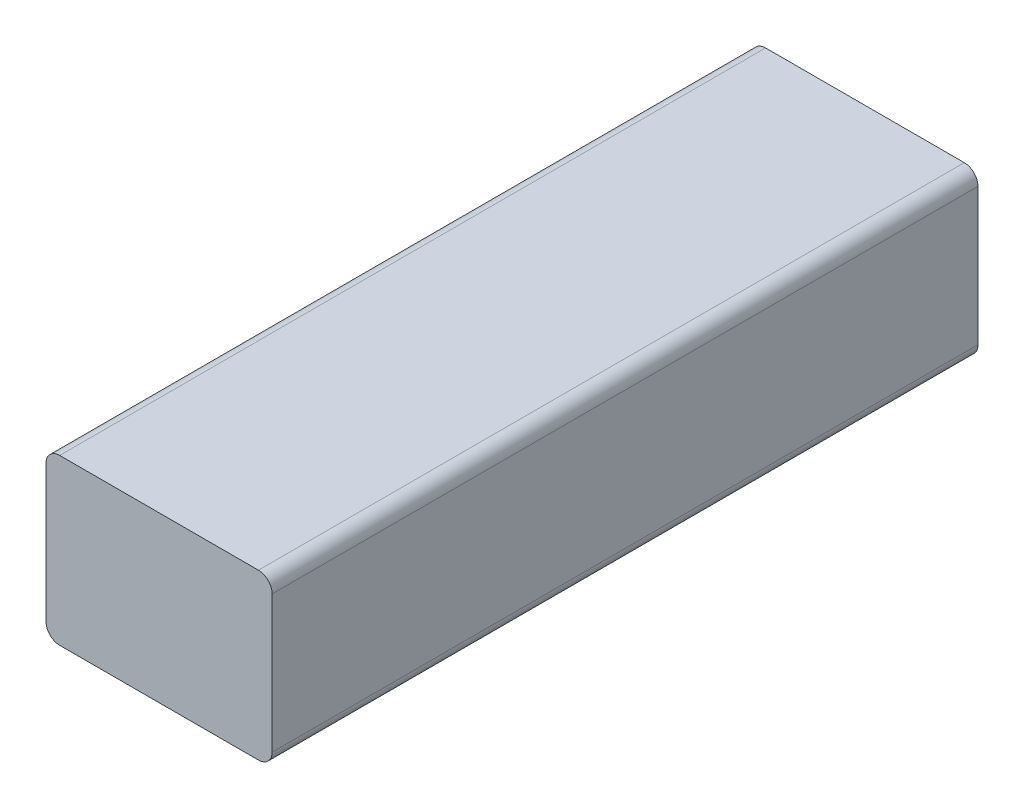
ISO-10303-21;
HEADER;
FILE_DESCRIPTION(('STEP AP214'),'2;1');
FILE_NAME('part.step','',(''),(''),'','','');
FILE_SCHEMA(('AUTOMOTIVE_DESIGN { 1 0 10303 214 1 1 1 1 }'));
ENDSEC;
DATA;
#1=APPLICATION_CONTEXT('core data for automotive mechanical design processes');
#2=APPLICATION_PROTOCOL_DEFINITION('international standard','automotive_design',2000,#1);
#3=PRODUCT_CONTEXT('',#1,'mechanical');
#4=PRODUCT('Part','Part','',(#3));
#5=PRODUCT_RELATED_PRODUCT_CATEGORY('part','',(#4));
#6=PRODUCT_DEFINITION_FORMATION('','',#4);
#7=PRODUCT_DEFINITION_CONTEXT('part definition',#1,'design');
#8=PRODUCT_DEFINITION('design','',#6,#7);
#9=PRODUCT_DEFINITION_SHAPE('','',#8);
#10=(LENGTH_UNIT() NAMED_UNIT(*) SI_UNIT(.MILLI.,.METRE.));
#11=(NAMED_UNIT(*) PLANE_ANGLE_UNIT() SI_UNIT($,.RADIAN.));
#12=(NAMED_UNIT(*) SI_UNIT($,.STERADIAN.) SOLID_ANGLE_UNIT());
#13=UNCERTAINTY_MEASURE_WITH_UNIT(LENGTH_MEASURE(1.E-05),#10,'distance_accuracy_value','');
#14=(GEOMETRIC_REPRESENTATION_CONTEXT(3) GLOBAL_UNCERTAINTY_ASSIGNED_CONTEXT((#13)) GLOBAL_UNIT_ASSIGNED_CONTEXT((#10,
#11,#12)) REPRESENTATION_CONTEXT('',''));
#15=CARTESIAN_POINT('',(0.,0.,0.));
#16=DIRECTION('',(0.,0.,1.));
#17=DIRECTION('',(1.,0.,0.));
#18=AXIS2_PLACEMENT_3D('',#15,#16,#17);
#19=CARTESIAN_POINT('',(16.5,24.,51.5));
#20=DIRECTION('',(-1.,0.,0.));
#21=DIRECTION('',(0.,0.,1.));
#22=AXIS2_PLACEMENT_3D('',#19,#20,#21);
#23=PLANE('',#22);
#24=DIRECTION('',(0.,-1.,0.));
#25=VECTOR('',#24,1.);
#26=CARTESIAN_POINT('',(16.5,24.,51.5));
#27=LINE('',#26,#25);
#28=CARTESIAN_POINT('',(16.5,22.,51.5));
#29=VERTEX_POINT('',#28);
#30=CARTESIAN_POINT('',(16.5,2.,51.5));
#31=VERTEX_POINT('',#30);
#32=EDGE_CURVE('E125',#29,#31,#27,.T.);
#33=ORIENTED_EDGE('',*,*,#32,.T.);
#34=DIRECTION('',(0.,0.,-1.));
#35=VECTOR('',#34,1.);
#36=CARTESIAN_POINT('',(16.5,2.,-51.5));
#37=LINE('',#36,#35);
#38=CARTESIAN_POINT('',(16.5,2.,-51.5));
#39=VERTEX_POINT('',#38);
#40=EDGE_CURVE('E11',#31,#39,#37,.T.);
#41=ORIENTED_EDGE('',*,*,#40,.T.);
#42=DIRECTION('',(0.,-1.,0.));
#43=VECTOR('',#42,1.);
#44=CARTESIAN_POINT('',(16.5,24.,-51.5));
#45=LINE('',#44,#43);
#46=CARTESIAN_POINT('',(16.5,22.,-51.5));
#47=VERTEX_POINT('',#46);
#48=EDGE_CURVE('E130',#47,#39,#45,.T.);
#49=ORIENTED_EDGE('',*,*,#48,.F.);
#50=DIRECTION('',(0.,0.,-1.));
#51=VECTOR('',#50,1.);
#52=CARTESIAN_POINT('',(16.5,22.,51.5));
#53=LINE('',#52,#51);
#54=EDGE_CURVE('E45',#47,#29,#53,.F.);
#55=ORIENTED_EDGE('',*,*,#54,.T.);
#56=EDGE_LOOP('',(#33,#41,#49,#55));
#57=FACE_BOUND('',#56,.T.);
#58=ADVANCED_FACE('F37',(#57),#23,.F.);
#59=CARTESIAN_POINT('',(-16.5,24.,-51.5));
#60=DIRECTION('',(0.,0.,1.));
#61=DIRECTION('',(1.,0.,0.));
#62=AXIS2_PLACEMENT_3D('',#59,#60,#61);
#63=PLANE('',#62);
#64=DIRECTION('',(-1.,0.,0.));
#65=VECTOR('',#64,1.);
#66=CARTESIAN_POINT('',(-16.5,0.,-51.5));
#67=LINE('',#66,#65);
#68=CARTESIAN_POINT('',(14.5,0.,-51.5));
#69=VERTEX_POINT('',#68);
#70=CARTESIAN_POINT('',(-14.5,0.,-51.5));
#71=VERTEX_POINT('',#70);
#72=EDGE_CURVE('E172',#69,#71,#67,.T.);
#73=ORIENTED_EDGE('',*,*,#72,.T.);
#74=CARTESIAN_POINT('',(-14.5,2.,-51.5));
#75=DIRECTION('',(0.,0.,1.));
#76=DIRECTION('',(1.,0.,0.));
#77=AXIS2_PLACEMENT_3D('',#74,#75,#76);
#78=CIRCLE('',#77,2.);
#79=CARTESIAN_POINT('',(-16.5,2.,-51.5));
#80=VERTEX_POINT('',#79);
#81=EDGE_CURVE('E147',#71,#80,#78,.F.);
#82=ORIENTED_EDGE('',*,*,#81,.T.);
#83=DIRECTION('',(0.,-1.,0.));
#84=VECTOR('',#83,1.);
#85=CARTESIAN_POINT('',(-16.5,24.,-51.5));
#86=LINE('',#85,#84);
#87=CARTESIAN_POINT('',(-16.5,22.,-51.5));
#88=VERTEX_POINT('',#87);
#89=EDGE_CURVE('E124',#88,#80,#86,.T.);
#90=ORIENTED_EDGE('',*,*,#89,.F.);
#91=CARTESIAN_POINT('',(-14.5,22.,-51.5));
#92=DIRECTION('',(0.,0.,1.));
#93=DIRECTION('',(1.,0.,0.));
#94=AXIS2_PLACEMENT_3D('',#91,#92,#93);
#95=CIRCLE('',#94,2.);
#96=CARTESIAN_POINT('',(-14.5,24.,-51.5));
#97=VERTEX_POINT('',#96);
#98=EDGE_CURVE('E129',#88,#97,#95,.F.);
#99=ORIENTED_EDGE('',*,*,#98,.T.);
#100=DIRECTION('',(-1.,0.,0.));
#101=VECTOR('',#100,1.);
#102=CARTESIAN_POINT('',(-16.5,24.,-51.5));
#103=LINE('',#102,#101);
#104=CARTESIAN_POINT('',(14.5,24.,-51.5));
#105=VERTEX_POINT('',#104);
#106=EDGE_CURVE('E166',#105,#97,#103,.T.);
#107=ORIENTED_EDGE('',*,*,#106,.F.);
#108=CARTESIAN_POINT('',(14.5,22.,-51.5));
#109=DIRECTION('',(0.,0.,1.));
#110=DIRECTION('',(1.,0.,0.));
#111=AXIS2_PLACEMENT_3D('',#108,#109,#110);
#112=CIRCLE('',#111,2.);
#113=EDGE_CURVE('E59',#105,#47,#112,.F.);
#114=ORIENTED_EDGE('',*,*,#113,.T.);
#115=ORIENTED_EDGE('',*,*,#48,.T.);
#116=CARTESIAN_POINT('',(14.5,2.,-51.5));
#117=DIRECTION('',(0.,0.,1.));
#118=DIRECTION('',(1.,0.,0.));
#119=AXIS2_PLACEMENT_3D('',#116,#117,#118);
#120=CIRCLE('',#119,2.);
#121=EDGE_CURVE('E52',#39,#69,#120,.F.);
#122=ORIENTED_EDGE('',*,*,#121,.T.);
#123=EDGE_LOOP('',(#73,#82,#90,#99,#107,#114,#115,#122));
#124=FACE_BOUND('',#123,.T.);
#125=ADVANCED_FACE('F168',(#124),#63,.F.);
#126=CARTESIAN_POINT('',(-16.5,24.,51.5));
#127=DIRECTION('',(1.,0.,0.));
#128=DIRECTION('',(0.,0.,-1.));
#129=AXIS2_PLACEMENT_3D('',#126,#127,#128);
#130=PLANE('',#129);
#131=ORIENTED_EDGE('',*,*,#89,.T.);
#132=DIRECTION('',(0.,0.,1.));
#133=VECTOR('',#132,1.);
#134=CARTESIAN_POINT('',(-16.5,2.,51.5));
#135=LINE('',#134,#133);
#136=CARTESIAN_POINT('',(-16.5,2.,51.5));
#137=VERTEX_POINT('',#136);
#138=EDGE_CURVE('E123',#80,#137,#135,.T.);
#139=ORIENTED_EDGE('',*,*,#138,.T.);
#140=DIRECTION('',(0.,-1.,0.));
#141=VECTOR('',#140,1.);
#142=CARTESIAN_POINT('',(-16.5,24.,51.5));
#143=LINE('',#142,#141);
#144=CARTESIAN_POINT('',(-16.5,22.,51.5));
#145=VERTEX_POINT('',#144);
#146=EDGE_CURVE('E106',#145,#137,#143,.T.);
#147=ORIENTED_EDGE('',*,*,#146,.F.);
#148=DIRECTION('',(0.,0.,1.));
#149=VECTOR('',#148,1.);
#150=CARTESIAN_POINT('',(-16.5,22.,51.5));
#151=LINE('',#150,#149);
#152=EDGE_CURVE('E120',#145,#88,#151,.F.);
#153=ORIENTED_EDGE('',*,*,#152,.T.);
#154=EDGE_LOOP('',(#131,#139,#147,#153));
#155=FACE_BOUND('',#154,.T.);
#156=ADVANCED_FACE('F119',(#155),#130,.F.);
#157=CARTESIAN_POINT('',(-16.5,24.,51.5));
#158=DIRECTION('',(0.,0.,-1.));
#159=DIRECTION('',(-1.,0.,0.));
#160=AXIS2_PLACEMENT_3D('',#157,#158,#159);
#161=PLANE('',#160);
#162=ORIENTED_EDGE('',*,*,#146,.T.);
#163=CARTESIAN_POINT('',(-14.5,2.,51.5));
#164=DIRECTION('',(0.,0.,-1.));
#165=DIRECTION('',(-1.,0.,0.));
#166=AXIS2_PLACEMENT_3D('',#163,#164,#165);
#167=CIRCLE('',#166,2.);
#168=CARTESIAN_POINT('',(-14.5,0.,51.5));
#169=VERTEX_POINT('',#168);
#170=EDGE_CURVE('E113',#137,#169,#167,.F.);
#171=ORIENTED_EDGE('',*,*,#170,.T.);
#172=DIRECTION('',(1.,0.,0.));
#173=VECTOR('',#172,1.);
#174=CARTESIAN_POINT('',(-16.5,0.,51.5));
#175=LINE('',#174,#173);
#176=CARTESIAN_POINT('',(14.5,0.,51.5));
#177=VERTEX_POINT('',#176);
#178=EDGE_CURVE('E169',#169,#177,#175,.T.);
#179=ORIENTED_EDGE('',*,*,#178,.T.);
#180=CARTESIAN_POINT('',(14.5,2.,51.5));
#181=DIRECTION('',(0.,0.,-1.));
#182=DIRECTION('',(-1.,0.,0.));
#183=AXIS2_PLACEMENT_3D('',#180,#181,#182);
#184=CIRCLE('',#183,2.);
#185=EDGE_CURVE('E114',#177,#31,#184,.F.);
#186=ORIENTED_EDGE('',*,*,#185,.T.);
#187=ORIENTED_EDGE('',*,*,#32,.F.);
#188=CARTESIAN_POINT('',(14.5,22.,51.5));
#189=DIRECTION('',(0.,0.,-1.));
#190=DIRECTION('',(-1.,0.,0.));
#191=AXIS2_PLACEMENT_3D('',#188,#189,#190);
#192=CIRCLE('',#191,2.);
#193=CARTESIAN_POINT('',(14.5,24.,51.5));
#194=VERTEX_POINT('',#193);
#195=EDGE_CURVE('E132',#29,#194,#192,.F.);
#196=ORIENTED_EDGE('',*,*,#195,.T.);
#197=DIRECTION('',(1.,0.,0.));
#198=VECTOR('',#197,1.);
#199=CARTESIAN_POINT('',(-16.5,24.,51.5));
#200=LINE('',#199,#198);
#201=CARTESIAN_POINT('',(-14.5,24.,51.5));
#202=VERTEX_POINT('',#201);
#203=EDGE_CURVE('E108',#202,#194,#200,.T.);
#204=ORIENTED_EDGE('',*,*,#203,.F.);
#205=CARTESIAN_POINT('',(-14.5,22.,51.5));
#206=DIRECTION('',(0.,0.,-1.));
#207=DIRECTION('',(-1.,0.,0.));
#208=AXIS2_PLACEMENT_3D('',#205,#206,#207);
#209=CIRCLE('',#208,2.);
#210=EDGE_CURVE('E103',#202,#145,#209,.F.);
#211=ORIENTED_EDGE('',*,*,#210,.T.);
#212=EDGE_LOOP('',(#162,#171,#179,#186,#187,#196,#204,#211));
#213=FACE_BOUND('',#212,.T.);
#214=ADVANCED_FACE('F105',(#213),#161,.F.);
#215=CARTESIAN_POINT('',(0.,24.,0.));
#216=DIRECTION('',(0.,-1.,0.));
#217=DIRECTION('',(0.,0.,-1.));
#218=AXIS2_PLACEMENT_3D('',#215,#216,#217);
#219=PLANE('',#218);
#220=ORIENTED_EDGE('',*,*,#106,.T.);
#221=DIRECTION('',(0.,0.,1.));
#222=VECTOR('',#221,1.);
#223=CARTESIAN_POINT('',(-14.5,24.,0.));
#224=LINE('',#223,#222);
#225=EDGE_CURVE('E152',#97,#202,#224,.T.);
#226=ORIENTED_EDGE('',*,*,#225,.T.);
#227=ORIENTED_EDGE('',*,*,#203,.T.);
#228=DIRECTION('',(0.,0.,-1.));
#229=VECTOR('',#228,1.);
#230=CARTESIAN_POINT('',(14.5,24.,0.));
#231=LINE('',#230,#229);
#232=EDGE_CURVE('E149',#194,#105,#231,.T.);
#233=ORIENTED_EDGE('',*,*,#232,.T.);
#234=EDGE_LOOP('',(#220,#226,#227,#233));
#235=FACE_BOUND('',#234,.T.);
#236=ADVANCED_FACE('F165',(#235),#219,.F.);
#237=CARTESIAN_POINT('',(0.,0.,0.));
#238=DIRECTION('',(0.,-1.,0.));
#239=DIRECTION('',(0.,0.,-1.));
#240=AXIS2_PLACEMENT_3D('',#237,#238,#239);
#241=PLANE('',#240);
#242=ORIENTED_EDGE('',*,*,#178,.F.);
#243=DIRECTION('',(0.,0.,1.));
#244=VECTOR('',#243,1.);
#245=CARTESIAN_POINT('',(-14.5,0.,-51.5));
#246=LINE('',#245,#244);
#247=EDGE_CURVE('E142',#169,#71,#246,.F.);
#248=ORIENTED_EDGE('',*,*,#247,.T.);
#249=ORIENTED_EDGE('',*,*,#72,.F.);
#250=DIRECTION('',(0.,0.,-1.));
#251=VECTOR('',#250,1.);
#252=CARTESIAN_POINT('',(14.5,0.,51.5));
#253=LINE('',#252,#251);
#254=EDGE_CURVE('E140',#69,#177,#253,.F.);
#255=ORIENTED_EDGE('',*,*,#254,.T.);
#256=EDGE_LOOP('',(#242,#248,#249,#255));
#257=FACE_BOUND('',#256,.T.);
#258=ADVANCED_FACE('F181',(#257),#241,.T.);
#259=CARTESIAN_POINT('',(-14.5,2.,51.5));
#260=DIRECTION('',(0.,0.,-1.));
#261=DIRECTION('',(-1.,0.,0.));
#262=AXIS2_PLACEMENT_3D('',#259,#260,#261);
#263=CYLINDRICAL_SURFACE('',#262,2.);
#264=ORIENTED_EDGE('',*,*,#81,.F.);
#265=ORIENTED_EDGE('',*,*,#247,.F.);
#266=ORIENTED_EDGE('',*,*,#170,.F.);
#267=ORIENTED_EDGE('',*,*,#138,.F.);
#268=EDGE_LOOP('',(#264,#265,#266,#267));
#269=FACE_BOUND('',#268,.T.);
#270=ADVANCED_FACE('F177',(#269),#263,.T.);
#271=CARTESIAN_POINT('',(-14.5,22.,0.));
#272=DIRECTION('',(0.,0.,1.));
#273=DIRECTION('',(1.,0.,0.));
#274=AXIS2_PLACEMENT_3D('',#271,#272,#273);
#275=CYLINDRICAL_SURFACE('',#274,2.);
#276=ORIENTED_EDGE('',*,*,#98,.F.);
#277=ORIENTED_EDGE('',*,*,#152,.F.);
#278=ORIENTED_EDGE('',*,*,#210,.F.);
#279=ORIENTED_EDGE('',*,*,#225,.F.);
#280=EDGE_LOOP('',(#276,#277,#278,#279));
#281=FACE_BOUND('',#280,.T.);
#282=ADVANCED_FACE('F128',(#281),#275,.T.);
#283=CARTESIAN_POINT('',(14.5,2.,51.5));
#284=DIRECTION('',(0.,0.,1.));
#285=DIRECTION('',(1.,0.,0.));
#286=AXIS2_PLACEMENT_3D('',#283,#284,#285);
#287=CYLINDRICAL_SURFACE('',#286,2.);
#288=ORIENTED_EDGE('',*,*,#185,.F.);
#289=ORIENTED_EDGE('',*,*,#254,.F.);
#290=ORIENTED_EDGE('',*,*,#121,.F.);
#291=ORIENTED_EDGE('',*,*,#40,.F.);
#292=EDGE_LOOP('',(#288,#289,#290,#291));
#293=FACE_BOUND('',#292,.T.);
#294=ADVANCED_FACE('F183',(#293),#287,.T.);
#295=CARTESIAN_POINT('',(14.5,22.,0.));
#296=DIRECTION('',(0.,0.,-1.));
#297=DIRECTION('',(-1.,0.,0.));
#298=AXIS2_PLACEMENT_3D('',#295,#296,#297);
#299=CYLINDRICAL_SURFACE('',#298,2.);
#300=ORIENTED_EDGE('',*,*,#195,.F.);
#301=ORIENTED_EDGE('',*,*,#54,.F.);
#302=ORIENTED_EDGE('',*,*,#113,.F.);
#303=ORIENTED_EDGE('',*,*,#232,.F.);
#304=EDGE_LOOP('',(#300,#301,#302,#303));
#305=FACE_BOUND('',#304,.T.);
#306=ADVANCED_FACE('F39',(#305),#299,.T.);
#307=CLOSED_SHELL('',(#58,#125,#156,#214,#236,#258,#270,#282,#294,#306));
#308=MANIFOLD_SOLID_BREP('B2',#307);
#309=ADVANCED_BREP_SHAPE_REPRESENTATION('',(#18,#308),#14);
#310=SHAPE_DEFINITION_REPRESENTATION(#9,#309);
ENDSEC;
END-ISO-10303-21;
